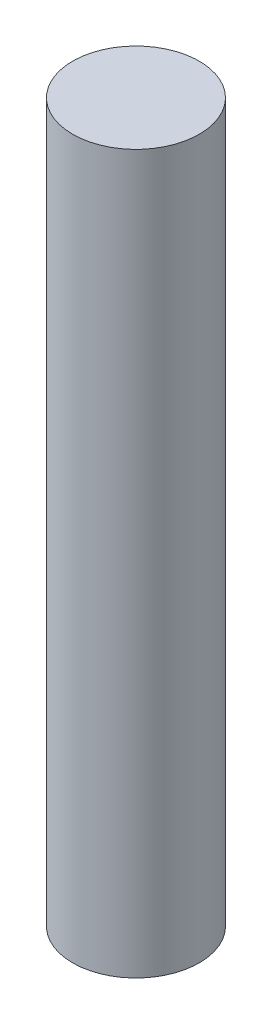
ISO-10303-21;
HEADER;
FILE_DESCRIPTION(('STEP AP214'),'2;1');
FILE_NAME('part.step','',(''),(''),'','','');
FILE_SCHEMA(('AUTOMOTIVE_DESIGN { 1 0 10303 214 1 1 1 1 }'));
ENDSEC;
DATA;
#1=APPLICATION_CONTEXT('core data for automotive mechanical design processes');
#2=APPLICATION_PROTOCOL_DEFINITION('international standard','automotive_design',2000,#1);
#3=PRODUCT_CONTEXT('',#1,'mechanical');
#4=PRODUCT('Part','Part','',(#3));
#5=PRODUCT_RELATED_PRODUCT_CATEGORY('part','',(#4));
#6=PRODUCT_DEFINITION_FORMATION('','',#4);
#7=PRODUCT_DEFINITION_CONTEXT('part definition',#1,'design');
#8=PRODUCT_DEFINITION('design','',#6,#7);
#9=PRODUCT_DEFINITION_SHAPE('','',#8);
#10=(LENGTH_UNIT() NAMED_UNIT(*) SI_UNIT(.MILLI.,.METRE.));
#11=(NAMED_UNIT(*) PLANE_ANGLE_UNIT() SI_UNIT($,.RADIAN.));
#12=(NAMED_UNIT(*) SI_UNIT($,.STERADIAN.) SOLID_ANGLE_UNIT());
#13=UNCERTAINTY_MEASURE_WITH_UNIT(LENGTH_MEASURE(1.E-05),#10,'distance_accuracy_value','');
#14=(GEOMETRIC_REPRESENTATION_CONTEXT(3) GLOBAL_UNCERTAINTY_ASSIGNED_CONTEXT((#13)) GLOBAL_UNIT_ASSIGNED_CONTEXT((#10,
#11,#12)) REPRESENTATION_CONTEXT('',''));
#15=CARTESIAN_POINT('',(0.,0.,0.));
#16=DIRECTION('',(0.,0.,1.));
#17=DIRECTION('',(1.,0.,0.));
#18=AXIS2_PLACEMENT_3D('',#15,#16,#17);
#19=CARTESIAN_POINT('',(0.,85.,0.));
#20=DIRECTION('',(0.,-1.,0.));
#21=DIRECTION('',(0.,0.,-1.));
#22=AXIS2_PLACEMENT_3D('',#19,#20,#21);
#23=CYLINDRICAL_SURFACE('',#22,7.5);
#24=CARTESIAN_POINT('',(0.,85.,0.));
#25=DIRECTION('',(0.,1.,0.));
#26=DIRECTION('',(0.,0.,1.));
#27=AXIS2_PLACEMENT_3D('',#24,#25,#26);
#28=CIRCLE('',#27,7.5);
#29=CARTESIAN_POINT('',(0.,85.,7.5));
#30=VERTEX_POINT('',#29);
#31=EDGE_CURVE('E10',#30,#30,#28,.T.);
#32=ORIENTED_EDGE('',*,*,#31,.F.);
#33=EDGE_LOOP('',(#32));
#34=FACE_BOUND('',#33,.T.);
#35=CARTESIAN_POINT('',(0.,0.,0.));
#36=DIRECTION('',(0.,1.,0.));
#37=DIRECTION('',(0.,0.,1.));
#38=AXIS2_PLACEMENT_3D('',#35,#36,#37);
#39=CIRCLE('',#38,7.5);
#40=CARTESIAN_POINT('',(0.,0.,7.5));
#41=VERTEX_POINT('',#40);
#42=EDGE_CURVE('E35',#41,#41,#39,.T.);
#43=ORIENTED_EDGE('',*,*,#42,.T.);
#44=EDGE_LOOP('',(#43));
#45=FACE_BOUND('',#44,.T.);
#46=ADVANCED_FACE('F32',(#34,#45),#23,.T.);
#47=CARTESIAN_POINT('',(0.,85.,0.));
#48=DIRECTION('',(0.,1.,0.));
#49=DIRECTION('',(0.,0.,1.));
#50=AXIS2_PLACEMENT_3D('',#47,#48,#49);
#51=PLANE('',#50);
#52=ORIENTED_EDGE('',*,*,#31,.T.);
#53=EDGE_LOOP('',(#52));
#54=FACE_BOUND('',#53,.T.);
#55=ADVANCED_FACE('F47',(#54),#51,.T.);
#56=CARTESIAN_POINT('',(0.,0.,0.));
#57=DIRECTION('',(0.,1.,0.));
#58=DIRECTION('',(0.,0.,1.));
#59=AXIS2_PLACEMENT_3D('',#56,#57,#58);
#60=PLANE('',#59);
#61=ORIENTED_EDGE('',*,*,#42,.F.);
#62=EDGE_LOOP('',(#61));
#63=FACE_BOUND('',#62,.T.);
#64=ADVANCED_FACE('F45',(#63),#60,.F.);
#65=CLOSED_SHELL('',(#46,#55,#64));
#66=MANIFOLD_SOLID_BREP('B2',#65);
#67=ADVANCED_BREP_SHAPE_REPRESENTATION('',(#18,#66),#14);
#68=SHAPE_DEFINITION_REPRESENTATION(#9,#67);
ENDSEC;
END-ISO-10303-21;
